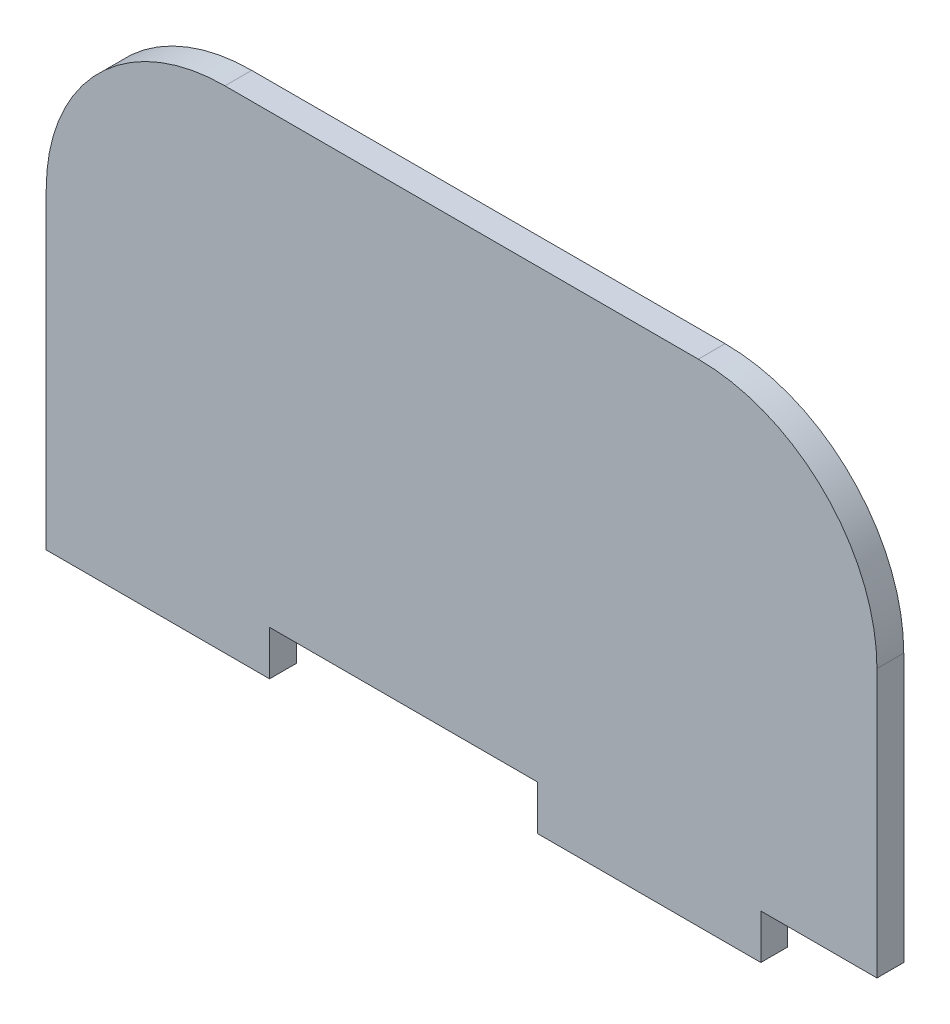
ISO-10303-21;
HEADER;
FILE_DESCRIPTION(('STEP AP214'),'2;1');
FILE_NAME('part.step','',(''),(''),'','','');
FILE_SCHEMA(('AUTOMOTIVE_DESIGN { 1 0 10303 214 1 1 1 1 }'));
ENDSEC;
DATA;
#1=APPLICATION_CONTEXT('core data for automotive mechanical design processes');
#2=APPLICATION_PROTOCOL_DEFINITION('international standard','automotive_design',2000,#1);
#3=PRODUCT_CONTEXT('',#1,'mechanical');
#4=PRODUCT('Part','Part','',(#3));
#5=PRODUCT_RELATED_PRODUCT_CATEGORY('part','',(#4));
#6=PRODUCT_DEFINITION_FORMATION('','',#4);
#7=PRODUCT_DEFINITION_CONTEXT('part definition',#1,'design');
#8=PRODUCT_DEFINITION('design','',#6,#7);
#9=PRODUCT_DEFINITION_SHAPE('','',#8);
#10=(LENGTH_UNIT() NAMED_UNIT(*) SI_UNIT(.MILLI.,.METRE.));
#11=(NAMED_UNIT(*) PLANE_ANGLE_UNIT() SI_UNIT($,.RADIAN.));
#12=(NAMED_UNIT(*) SI_UNIT($,.STERADIAN.) SOLID_ANGLE_UNIT());
#13=UNCERTAINTY_MEASURE_WITH_UNIT(LENGTH_MEASURE(1.E-05),#10,'distance_accuracy_value','');
#14=(GEOMETRIC_REPRESENTATION_CONTEXT(3) GLOBAL_UNCERTAINTY_ASSIGNED_CONTEXT((#13)) GLOBAL_UNIT_ASSIGNED_CONTEXT((#10,
#11,#12)) REPRESENTATION_CONTEXT('',''));
#15=CARTESIAN_POINT('',(0.,0.,0.));
#16=DIRECTION('',(0.,0.,1.));
#17=DIRECTION('',(1.,0.,0.));
#18=AXIS2_PLACEMENT_3D('',#15,#16,#17);
#19=CARTESIAN_POINT('',(56.0400810424611,28.6183048860703,3.));
#20=DIRECTION('',(-1.,0.,0.));
#21=DIRECTION('',(0.,-1.,0.));
#22=AXIS2_PLACEMENT_3D('',#19,#20,#21);
#23=PLANE('',#22);
#24=DIRECTION('',(0.,1.,0.));
#25=VECTOR('',#24,1.);
#26=CARTESIAN_POINT('',(56.0400810424611,28.6183048860703,0.));
#27=LINE('',#26,#25);
#28=CARTESIAN_POINT('',(56.0400810424612,-1.38169511392967,0.));
#29=VERTEX_POINT('',#28);
#30=CARTESIAN_POINT('',(56.0400810424611,28.6183048860703,0.));
#31=VERTEX_POINT('',#30);
#32=EDGE_CURVE('E153',#29,#31,#27,.T.);
#33=ORIENTED_EDGE('',*,*,#32,.T.);
#34=DIRECTION('',(0.,0.,-1.));
#35=VECTOR('',#34,1.);
#36=CARTESIAN_POINT('',(56.0400810424611,28.6183048860703,3.));
#37=LINE('',#36,#35);
#38=CARTESIAN_POINT('',(56.0400810424611,28.6183048860703,3.));
#39=VERTEX_POINT('',#38);
#40=EDGE_CURVE('E11',#39,#31,#37,.T.);
#41=ORIENTED_EDGE('',*,*,#40,.F.);
#42=DIRECTION('',(0.,1.,0.));
#43=VECTOR('',#42,1.);
#44=CARTESIAN_POINT('',(56.0400810424611,28.6183048860703,3.));
#45=LINE('',#44,#43);
#46=CARTESIAN_POINT('',(56.0400810424612,-1.38169511392967,3.));
#47=VERTEX_POINT('',#46);
#48=EDGE_CURVE('E176',#47,#39,#45,.T.);
#49=ORIENTED_EDGE('',*,*,#48,.F.);
#50=DIRECTION('',(0.,0.,-1.));
#51=VECTOR('',#50,1.);
#52=CARTESIAN_POINT('',(56.0400810424612,-1.38169511392967,3.));
#53=LINE('',#52,#51);
#54=EDGE_CURVE('E149',#47,#29,#53,.T.);
#55=ORIENTED_EDGE('',*,*,#54,.T.);
#56=EDGE_LOOP('',(#33,#41,#49,#55));
#57=FACE_BOUND('',#56,.T.);
#58=ADVANCED_FACE('F33',(#57),#23,.F.);
#59=CARTESIAN_POINT('',(36.0400810424611,28.6183048860703,3.));
#60=DIRECTION('',(0.,0.,-1.));
#61=DIRECTION('',(-1.,0.,0.));
#62=AXIS2_PLACEMENT_3D('',#59,#60,#61);
#63=CYLINDRICAL_SURFACE('',#62,20.);
#64=CARTESIAN_POINT('',(36.0400810424611,28.6183048860703,0.));
#65=DIRECTION('',(0.,0.,1.));
#66=DIRECTION('',(-1.,0.,0.));
#67=AXIS2_PLACEMENT_3D('',#64,#65,#66);
#68=CIRCLE('',#67,20.);
#69=CARTESIAN_POINT('',(36.0400810424611,48.6183048860703,0.));
#70=VERTEX_POINT('',#69);
#71=EDGE_CURVE('E156',#31,#70,#68,.T.);
#72=ORIENTED_EDGE('',*,*,#71,.T.);
#73=DIRECTION('',(0.,0.,-1.));
#74=VECTOR('',#73,1.);
#75=CARTESIAN_POINT('',(36.0400810424611,48.6183048860703,3.));
#76=LINE('',#75,#74);
#77=CARTESIAN_POINT('',(36.0400810424611,48.6183048860703,3.));
#78=VERTEX_POINT('',#77);
#79=EDGE_CURVE('E41',#78,#70,#76,.T.);
#80=ORIENTED_EDGE('',*,*,#79,.F.);
#81=CARTESIAN_POINT('',(36.0400810424611,28.6183048860703,3.));
#82=DIRECTION('',(0.,0.,1.));
#83=DIRECTION('',(-1.,0.,0.));
#84=AXIS2_PLACEMENT_3D('',#81,#82,#83);
#85=CIRCLE('',#84,20.);
#86=EDGE_CURVE('E104',#39,#78,#85,.T.);
#87=ORIENTED_EDGE('',*,*,#86,.F.);
#88=ORIENTED_EDGE('',*,*,#40,.T.);
#89=EDGE_LOOP('',(#72,#80,#87,#88));
#90=FACE_BOUND('',#89,.T.);
#91=ADVANCED_FACE('F253',(#90),#63,.T.);
#92=CARTESIAN_POINT('',(-16.9599189575389,48.6183048860703,3.));
#93=DIRECTION('',(0.,-1.,0.));
#94=DIRECTION('',(1.,0.,0.));
#95=AXIS2_PLACEMENT_3D('',#92,#93,#94);
#96=PLANE('',#95);
#97=DIRECTION('',(-1.,0.,0.));
#98=VECTOR('',#97,1.);
#99=CARTESIAN_POINT('',(-16.9599189575389,48.6183048860703,0.));
#100=LINE('',#99,#98);
#101=CARTESIAN_POINT('',(-16.9599189575389,48.6183048860703,0.));
#102=VERTEX_POINT('',#101);
#103=EDGE_CURVE('E158',#70,#102,#100,.T.);
#104=ORIENTED_EDGE('',*,*,#103,.T.);
#105=DIRECTION('',(0.,0.,-1.));
#106=VECTOR('',#105,1.);
#107=CARTESIAN_POINT('',(-16.9599189575389,48.6183048860703,3.));
#108=LINE('',#107,#106);
#109=CARTESIAN_POINT('',(-16.9599189575389,48.6183048860703,3.));
#110=VERTEX_POINT('',#109);
#111=EDGE_CURVE('E195',#110,#102,#108,.T.);
#112=ORIENTED_EDGE('',*,*,#111,.F.);
#113=DIRECTION('',(-1.,0.,0.));
#114=VECTOR('',#113,1.);
#115=CARTESIAN_POINT('',(-16.9599189575389,48.6183048860703,3.));
#116=LINE('',#115,#114);
#117=EDGE_CURVE('E203',#78,#110,#116,.T.);
#118=ORIENTED_EDGE('',*,*,#117,.F.);
#119=ORIENTED_EDGE('',*,*,#79,.T.);
#120=EDGE_LOOP('',(#104,#112,#118,#119));
#121=FACE_BOUND('',#120,.T.);
#122=ADVANCED_FACE('F201',(#121),#96,.F.);
#123=CARTESIAN_POINT('',(-16.9599189575389,28.6183048860703,3.));
#124=DIRECTION('',(0.,0.,-1.));
#125=DIRECTION('',(-1.,0.,0.));
#126=AXIS2_PLACEMENT_3D('',#123,#124,#125);
#127=CYLINDRICAL_SURFACE('',#126,20.);
#128=CARTESIAN_POINT('',(-16.9599189575389,28.6183048860703,0.));
#129=DIRECTION('',(0.,0.,1.));
#130=DIRECTION('',(1.,0.,0.));
#131=AXIS2_PLACEMENT_3D('',#128,#129,#130);
#132=CIRCLE('',#131,20.);
#133=CARTESIAN_POINT('',(-36.9599189575389,28.6183048860703,0.));
#134=VERTEX_POINT('',#133);
#135=EDGE_CURVE('E160',#102,#134,#132,.T.);
#136=ORIENTED_EDGE('',*,*,#135,.T.);
#137=DIRECTION('',(0.,0.,-1.));
#138=VECTOR('',#137,1.);
#139=CARTESIAN_POINT('',(-36.9599189575389,28.6183048860703,3.));
#140=LINE('',#139,#138);
#141=CARTESIAN_POINT('',(-36.9599189575389,28.6183048860703,3.));
#142=VERTEX_POINT('',#141);
#143=EDGE_CURVE('E192',#142,#134,#140,.T.);
#144=ORIENTED_EDGE('',*,*,#143,.F.);
#145=CARTESIAN_POINT('',(-16.9599189575389,28.6183048860703,3.));
#146=DIRECTION('',(0.,0.,1.));
#147=DIRECTION('',(1.,0.,0.));
#148=AXIS2_PLACEMENT_3D('',#145,#146,#147);
#149=CIRCLE('',#148,20.);
#150=EDGE_CURVE('E220',#110,#142,#149,.T.);
#151=ORIENTED_EDGE('',*,*,#150,.F.);
#152=ORIENTED_EDGE('',*,*,#111,.T.);
#153=EDGE_LOOP('',(#136,#144,#151,#152));
#154=FACE_BOUND('',#153,.T.);
#155=ADVANCED_FACE('F211',(#154),#127,.T.);
#156=CARTESIAN_POINT('',(-36.9599189575388,-1.38169511392967,3.));
#157=DIRECTION('',(1.,0.,0.));
#158=DIRECTION('',(0.,0.,-1.));
#159=AXIS2_PLACEMENT_3D('',#156,#157,#158);
#160=PLANE('',#159);
#161=DIRECTION('',(0.,-1.,0.));
#162=VECTOR('',#161,1.);
#163=CARTESIAN_POINT('',(-36.9599189575388,-1.38169511392967,0.));
#164=LINE('',#163,#162);
#165=CARTESIAN_POINT('',(-36.9599189575388,-6.38169511392967,0.));
#166=VERTEX_POINT('',#165);
#167=EDGE_CURVE('E163',#134,#166,#164,.T.);
#168=ORIENTED_EDGE('',*,*,#167,.T.);
#169=DIRECTION('',(0.,0.,-1.));
#170=VECTOR('',#169,1.);
#171=CARTESIAN_POINT('',(-36.9599189575388,-6.38169511392967,3.));
#172=LINE('',#171,#170);
#173=CARTESIAN_POINT('',(-36.9599189575388,-6.38169511392967,3.));
#174=VERTEX_POINT('',#173);
#175=EDGE_CURVE('E189',#174,#166,#172,.T.);
#176=ORIENTED_EDGE('',*,*,#175,.F.);
#177=DIRECTION('',(0.,-1.,0.));
#178=VECTOR('',#177,1.);
#179=CARTESIAN_POINT('',(-36.9599189575389,28.6183048860703,3.));
#180=LINE('',#179,#178);
#181=EDGE_CURVE('E217',#142,#174,#180,.T.);
#182=ORIENTED_EDGE('',*,*,#181,.F.);
#183=ORIENTED_EDGE('',*,*,#143,.T.);
#184=EDGE_LOOP('',(#168,#176,#182,#183));
#185=FACE_BOUND('',#184,.T.);
#186=ADVANCED_FACE('F215',(#185),#160,.F.);
#187=CARTESIAN_POINT('',(-36.9599189575388,-6.38169511392967,3.));
#188=DIRECTION('',(0.,1.,0.));
#189=DIRECTION('',(0.,0.,1.));
#190=AXIS2_PLACEMENT_3D('',#187,#188,#189);
#191=PLANE('',#190);
#192=DIRECTION('',(1.,0.,0.));
#193=VECTOR('',#192,1.);
#194=CARTESIAN_POINT('',(-36.9599189575388,-6.38169511392967,0.));
#195=LINE('',#194,#193);
#196=CARTESIAN_POINT('',(-11.9599189575389,-6.38169511392967,0.));
#197=VERTEX_POINT('',#196);
#198=EDGE_CURVE('E165',#166,#197,#195,.T.);
#199=ORIENTED_EDGE('',*,*,#198,.T.);
#200=DIRECTION('',(0.,0.,-1.));
#201=VECTOR('',#200,1.);
#202=CARTESIAN_POINT('',(-11.9599189575389,-6.38169511392967,3.));
#203=LINE('',#202,#201);
#204=CARTESIAN_POINT('',(-11.9599189575389,-6.38169511392967,3.));
#205=VERTEX_POINT('',#204);
#206=EDGE_CURVE('E186',#205,#197,#203,.T.);
#207=ORIENTED_EDGE('',*,*,#206,.F.);
#208=DIRECTION('',(1.,0.,0.));
#209=VECTOR('',#208,1.);
#210=CARTESIAN_POINT('',(-36.9599189575388,-6.38169511392967,3.));
#211=LINE('',#210,#209);
#212=EDGE_CURVE('E219',#174,#205,#211,.T.);
#213=ORIENTED_EDGE('',*,*,#212,.F.);
#214=ORIENTED_EDGE('',*,*,#175,.T.);
#215=EDGE_LOOP('',(#199,#207,#213,#214));
#216=FACE_BOUND('',#215,.T.);
#217=ADVANCED_FACE('F266',(#216),#191,.F.);
#218=CARTESIAN_POINT('',(-11.9599189575389,-1.38169511392967,3.));
#219=DIRECTION('',(-1.,0.,0.));
#220=DIRECTION('',(0.,0.,1.));
#221=AXIS2_PLACEMENT_3D('',#218,#219,#220);
#222=PLANE('',#221);
#223=DIRECTION('',(0.,1.,0.));
#224=VECTOR('',#223,1.);
#225=CARTESIAN_POINT('',(-11.9599189575389,-1.38169511392967,0.));
#226=LINE('',#225,#224);
#227=CARTESIAN_POINT('',(-11.9599189575389,-1.38169511392967,0.));
#228=VERTEX_POINT('',#227);
#229=EDGE_CURVE('E167',#197,#228,#226,.T.);
#230=ORIENTED_EDGE('',*,*,#229,.T.);
#231=DIRECTION('',(0.,0.,-1.));
#232=VECTOR('',#231,1.);
#233=CARTESIAN_POINT('',(-11.9599189575389,-1.38169511392967,3.));
#234=LINE('',#233,#232);
#235=CARTESIAN_POINT('',(-11.9599189575389,-1.38169511392967,3.));
#236=VERTEX_POINT('',#235);
#237=EDGE_CURVE('E183',#236,#228,#234,.T.);
#238=ORIENTED_EDGE('',*,*,#237,.F.);
#239=DIRECTION('',(0.,1.,0.));
#240=VECTOR('',#239,1.);
#241=CARTESIAN_POINT('',(-11.9599189575389,-1.38169511392967,3.));
#242=LINE('',#241,#240);
#243=EDGE_CURVE('E222',#205,#236,#242,.T.);
#244=ORIENTED_EDGE('',*,*,#243,.F.);
#245=ORIENTED_EDGE('',*,*,#206,.T.);
#246=EDGE_LOOP('',(#230,#238,#244,#245));
#247=FACE_BOUND('',#246,.T.);
#248=ADVANCED_FACE('F269',(#247),#222,.F.);
#249=CARTESIAN_POINT('',(-11.9599189575389,-1.38169511392967,3.));
#250=DIRECTION('',(0.,1.,0.));
#251=DIRECTION('',(0.,0.,1.));
#252=AXIS2_PLACEMENT_3D('',#249,#250,#251);
#253=PLANE('',#252);
#254=DIRECTION('',(1.,0.,0.));
#255=VECTOR('',#254,1.);
#256=CARTESIAN_POINT('',(-11.9599189575389,-1.38169511392967,0.));
#257=LINE('',#256,#255);
#258=CARTESIAN_POINT('',(18.0400810424611,-1.38169511392967,0.));
#259=VERTEX_POINT('',#258);
#260=EDGE_CURVE('E169',#228,#259,#257,.T.);
#261=ORIENTED_EDGE('',*,*,#260,.T.);
#262=DIRECTION('',(0.,0.,-1.));
#263=VECTOR('',#262,1.);
#264=CARTESIAN_POINT('',(18.0400810424611,-1.38169511392967,3.));
#265=LINE('',#264,#263);
#266=CARTESIAN_POINT('',(18.0400810424611,-1.38169511392967,3.));
#267=VERTEX_POINT('',#266);
#268=EDGE_CURVE('E180',#267,#259,#265,.T.);
#269=ORIENTED_EDGE('',*,*,#268,.F.);
#270=DIRECTION('',(1.,0.,0.));
#271=VECTOR('',#270,1.);
#272=CARTESIAN_POINT('',(-11.9599189575389,-1.38169511392967,3.));
#273=LINE('',#272,#271);
#274=EDGE_CURVE('E228',#236,#267,#273,.T.);
#275=ORIENTED_EDGE('',*,*,#274,.F.);
#276=ORIENTED_EDGE('',*,*,#237,.T.);
#277=EDGE_LOOP('',(#261,#269,#275,#276));
#278=FACE_BOUND('',#277,.T.);
#279=ADVANCED_FACE('F234',(#278),#253,.F.);
#280=CARTESIAN_POINT('',(18.0400810424611,-1.38169511392967,3.));
#281=DIRECTION('',(1.,0.,0.));
#282=DIRECTION('',(0.,1.,0.));
#283=AXIS2_PLACEMENT_3D('',#280,#281,#282);
#284=PLANE('',#283);
#285=DIRECTION('',(0.,-1.,0.));
#286=VECTOR('',#285,1.);
#287=CARTESIAN_POINT('',(18.0400810424611,-1.38169511392967,0.));
#288=LINE('',#287,#286);
#289=CARTESIAN_POINT('',(18.0400810424612,-6.38169511392967,0.));
#290=VERTEX_POINT('',#289);
#291=EDGE_CURVE('E171',#259,#290,#288,.T.);
#292=ORIENTED_EDGE('',*,*,#291,.T.);
#293=DIRECTION('',(0.,0.,-1.));
#294=VECTOR('',#293,1.);
#295=CARTESIAN_POINT('',(18.0400810424612,-6.38169511392967,3.));
#296=LINE('',#295,#294);
#297=CARTESIAN_POINT('',(18.0400810424612,-6.38169511392967,3.));
#298=VERTEX_POINT('',#297);
#299=EDGE_CURVE('E144',#298,#290,#296,.T.);
#300=ORIENTED_EDGE('',*,*,#299,.F.);
#301=DIRECTION('',(0.,-1.,0.));
#302=VECTOR('',#301,1.);
#303=CARTESIAN_POINT('',(18.0400810424611,-1.38169511392967,3.));
#304=LINE('',#303,#302);
#305=EDGE_CURVE('E135',#267,#298,#304,.T.);
#306=ORIENTED_EDGE('',*,*,#305,.F.);
#307=ORIENTED_EDGE('',*,*,#268,.T.);
#308=EDGE_LOOP('',(#292,#300,#306,#307));
#309=FACE_BOUND('',#308,.T.);
#310=ADVANCED_FACE('F238',(#309),#284,.F.);
#311=CARTESIAN_POINT('',(18.0400810424612,-6.38169511392967,3.));
#312=DIRECTION('',(0.,1.,0.));
#313=DIRECTION('',(-1.,0.,0.));
#314=AXIS2_PLACEMENT_3D('',#311,#312,#313);
#315=PLANE('',#314);
#316=DIRECTION('',(1.,0.,0.));
#317=VECTOR('',#316,1.);
#318=CARTESIAN_POINT('',(18.0400810424612,-6.38169511392967,0.));
#319=LINE('',#318,#317);
#320=CARTESIAN_POINT('',(43.0400810424612,-6.38169511392967,0.));
#321=VERTEX_POINT('',#320);
#322=EDGE_CURVE('E143',#290,#321,#319,.T.);
#323=ORIENTED_EDGE('',*,*,#322,.T.);
#324=DIRECTION('',(0.,0.,-1.));
#325=VECTOR('',#324,1.);
#326=CARTESIAN_POINT('',(43.0400810424612,-6.38169511392967,3.));
#327=LINE('',#326,#325);
#328=CARTESIAN_POINT('',(43.0400810424612,-6.38169511392967,3.));
#329=VERTEX_POINT('',#328);
#330=EDGE_CURVE('E140',#329,#321,#327,.T.);
#331=ORIENTED_EDGE('',*,*,#330,.F.);
#332=DIRECTION('',(1.,0.,0.));
#333=VECTOR('',#332,1.);
#334=CARTESIAN_POINT('',(18.0400810424612,-6.38169511392967,3.));
#335=LINE('',#334,#333);
#336=EDGE_CURVE('E129',#298,#329,#335,.T.);
#337=ORIENTED_EDGE('',*,*,#336,.F.);
#338=ORIENTED_EDGE('',*,*,#299,.T.);
#339=EDGE_LOOP('',(#323,#331,#337,#338));
#340=FACE_BOUND('',#339,.T.);
#341=ADVANCED_FACE('F141',(#340),#315,.F.);
#342=CARTESIAN_POINT('',(43.0400810424612,-1.38169511392967,3.));
#343=DIRECTION('',(-1.,0.,0.));
#344=DIRECTION('',(0.,0.,1.));
#345=AXIS2_PLACEMENT_3D('',#342,#343,#344);
#346=PLANE('',#345);
#347=DIRECTION('',(0.,1.,0.));
#348=VECTOR('',#347,1.);
#349=CARTESIAN_POINT('',(43.0400810424612,-1.38169511392967,0.));
#350=LINE('',#349,#348);
#351=CARTESIAN_POINT('',(43.0400810424612,-1.38169511392967,0.));
#352=VERTEX_POINT('',#351);
#353=EDGE_CURVE('E90',#321,#352,#350,.T.);
#354=ORIENTED_EDGE('',*,*,#353,.T.);
#355=DIRECTION('',(0.,0.,-1.));
#356=VECTOR('',#355,1.);
#357=CARTESIAN_POINT('',(43.0400810424612,-1.38169511392967,3.));
#358=LINE('',#357,#356);
#359=CARTESIAN_POINT('',(43.0400810424612,-1.38169511392967,3.));
#360=VERTEX_POINT('',#359);
#361=EDGE_CURVE('E145',#360,#352,#358,.T.);
#362=ORIENTED_EDGE('',*,*,#361,.F.);
#363=DIRECTION('',(0.,1.,0.));
#364=VECTOR('',#363,1.);
#365=CARTESIAN_POINT('',(43.0400810424612,-1.38169511392967,3.));
#366=LINE('',#365,#364);
#367=EDGE_CURVE('E133',#329,#360,#366,.T.);
#368=ORIENTED_EDGE('',*,*,#367,.F.);
#369=ORIENTED_EDGE('',*,*,#330,.T.);
#370=EDGE_LOOP('',(#354,#362,#368,#369));
#371=FACE_BOUND('',#370,.T.);
#372=ADVANCED_FACE('F147',(#371),#346,.F.);
#373=CARTESIAN_POINT('',(43.0400810424612,-1.38169511392967,3.));
#374=DIRECTION('',(0.,1.,0.));
#375=DIRECTION('',(-1.,0.,0.));
#376=AXIS2_PLACEMENT_3D('',#373,#374,#375);
#377=PLANE('',#376);
#378=DIRECTION('',(1.,0.,0.));
#379=VECTOR('',#378,1.);
#380=CARTESIAN_POINT('',(43.0400810424612,-1.38169511392967,0.));
#381=LINE('',#380,#379);
#382=EDGE_CURVE('E96',#352,#29,#381,.T.);
#383=ORIENTED_EDGE('',*,*,#382,.T.);
#384=ORIENTED_EDGE('',*,*,#54,.F.);
#385=DIRECTION('',(1.,0.,0.));
#386=VECTOR('',#385,1.);
#387=CARTESIAN_POINT('',(43.0400810424612,-1.38169511392967,3.));
#388=LINE('',#387,#386);
#389=EDGE_CURVE('E49',#360,#47,#388,.T.);
#390=ORIENTED_EDGE('',*,*,#389,.F.);
#391=ORIENTED_EDGE('',*,*,#361,.T.);
#392=EDGE_LOOP('',(#383,#384,#390,#391));
#393=FACE_BOUND('',#392,.T.);
#394=ADVANCED_FACE('F242',(#393),#377,.F.);
#395=CARTESIAN_POINT('',(-16.9599189575389,28.6183048860703,3.));
#396=DIRECTION('',(0.,0.,1.));
#397=DIRECTION('',(1.,0.,0.));
#398=AXIS2_PLACEMENT_3D('',#395,#396,#397);
#399=PLANE('',#398);
#400=ORIENTED_EDGE('',*,*,#48,.T.);
#401=ORIENTED_EDGE('',*,*,#86,.T.);
#402=ORIENTED_EDGE('',*,*,#117,.T.);
#403=ORIENTED_EDGE('',*,*,#150,.T.);
#404=ORIENTED_EDGE('',*,*,#181,.T.);
#405=ORIENTED_EDGE('',*,*,#212,.T.);
#406=ORIENTED_EDGE('',*,*,#243,.T.);
#407=ORIENTED_EDGE('',*,*,#274,.T.);
#408=ORIENTED_EDGE('',*,*,#305,.T.);
#409=ORIENTED_EDGE('',*,*,#336,.T.);
#410=ORIENTED_EDGE('',*,*,#367,.T.);
#411=ORIENTED_EDGE('',*,*,#389,.T.);
#412=EDGE_LOOP('',(#400,#401,#402,#403,#404,#405,#406,#407,#408,#409,#410,#411));
#413=FACE_BOUND('',#412,.T.);
#414=ADVANCED_FACE('F131',(#413),#399,.T.);
#415=CARTESIAN_POINT('',(-16.9599189575389,28.6183048860703,0.));
#416=DIRECTION('',(0.,0.,1.));
#417=DIRECTION('',(1.,0.,0.));
#418=AXIS2_PLACEMENT_3D('',#415,#416,#417);
#419=PLANE('',#418);
#420=ORIENTED_EDGE('',*,*,#32,.F.);
#421=ORIENTED_EDGE('',*,*,#382,.F.);
#422=ORIENTED_EDGE('',*,*,#353,.F.);
#423=ORIENTED_EDGE('',*,*,#322,.F.);
#424=ORIENTED_EDGE('',*,*,#291,.F.);
#425=ORIENTED_EDGE('',*,*,#260,.F.);
#426=ORIENTED_EDGE('',*,*,#229,.F.);
#427=ORIENTED_EDGE('',*,*,#198,.F.);
#428=ORIENTED_EDGE('',*,*,#167,.F.);
#429=ORIENTED_EDGE('',*,*,#135,.F.);
#430=ORIENTED_EDGE('',*,*,#103,.F.);
#431=ORIENTED_EDGE('',*,*,#71,.F.);
#432=EDGE_LOOP('',(#420,#421,#422,#423,#424,#425,#426,#427,#428,#429,#430,#431));
#433=FACE_BOUND('',#432,.T.);
#434=ADVANCED_FACE('F207',(#433),#419,.F.);
#435=CLOSED_SHELL('',(#58,#91,#122,#155,#186,#217,#248,#279,#310,#341,#372,#394,#414,#434));
#436=MANIFOLD_SOLID_BREP('B2',#435);
#437=ADVANCED_BREP_SHAPE_REPRESENTATION('',(#18,#436),#14);
#438=SHAPE_DEFINITION_REPRESENTATION(#9,#437);
ENDSEC;
END-ISO-10303-21;
